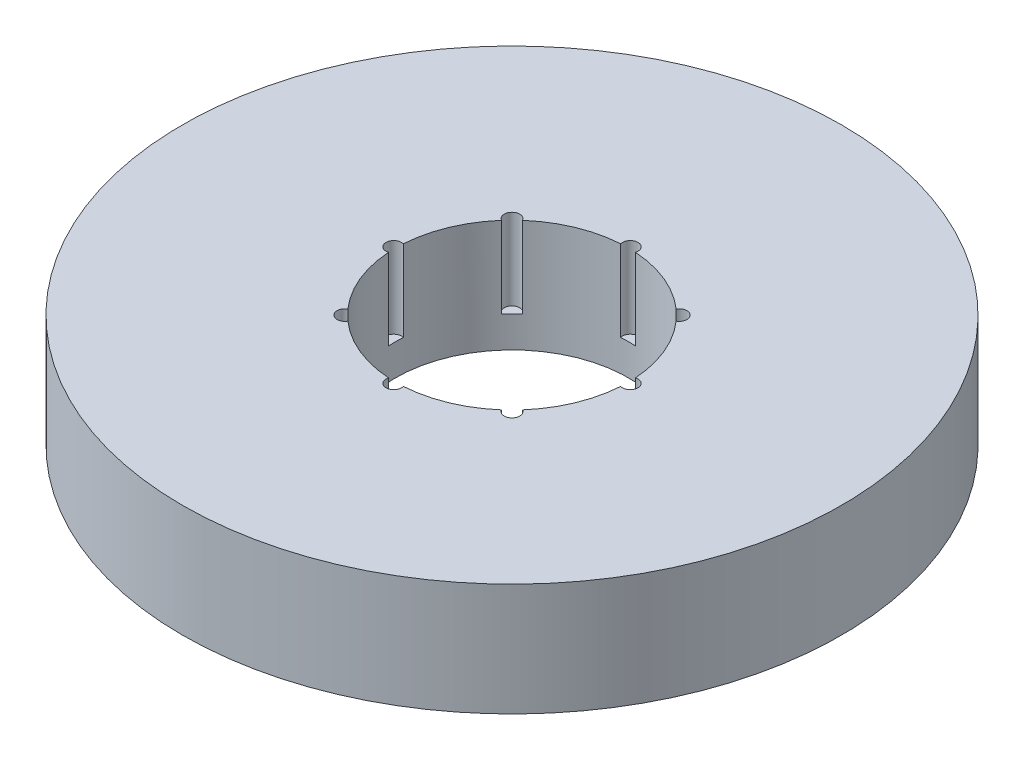
ISO-10303-21;
HEADER;
FILE_DESCRIPTION(('STEP AP214'),'2;1');
FILE_NAME('part.step','',(''),(''),'','','');
FILE_SCHEMA(('AUTOMOTIVE_DESIGN { 1 0 10303 214 1 1 1 1 }'));
ENDSEC;
DATA;
#1=APPLICATION_CONTEXT('core data for automotive mechanical design processes');
#2=APPLICATION_PROTOCOL_DEFINITION('international standard','automotive_design',2000,#1);
#3=PRODUCT_CONTEXT('',#1,'mechanical');
#4=PRODUCT('Part','Part','',(#3));
#5=PRODUCT_RELATED_PRODUCT_CATEGORY('part','',(#4));
#6=PRODUCT_DEFINITION_FORMATION('','',#4);
#7=PRODUCT_DEFINITION_CONTEXT('part definition',#1,'design');
#8=PRODUCT_DEFINITION('design','',#6,#7);
#9=PRODUCT_DEFINITION_SHAPE('','',#8);
#10=(LENGTH_UNIT() NAMED_UNIT(*) SI_UNIT(.MILLI.,.METRE.));
#11=(NAMED_UNIT(*) PLANE_ANGLE_UNIT() SI_UNIT($,.RADIAN.));
#12=(NAMED_UNIT(*) SI_UNIT($,.STERADIAN.) SOLID_ANGLE_UNIT());
#13=UNCERTAINTY_MEASURE_WITH_UNIT(LENGTH_MEASURE(1.E-05),#10,'distance_accuracy_value','');
#14=(GEOMETRIC_REPRESENTATION_CONTEXT(3) GLOBAL_UNCERTAINTY_ASSIGNED_CONTEXT((#13)) GLOBAL_UNIT_ASSIGNED_CONTEXT((#10,
#11,#12)) REPRESENTATION_CONTEXT('',''));
#15=CARTESIAN_POINT('',(0.,0.,0.));
#16=DIRECTION('',(0.,0.,1.));
#17=DIRECTION('',(1.,0.,0.));
#18=AXIS2_PLACEMENT_3D('',#15,#16,#17);
#19=CARTESIAN_POINT('',(0.,29.,0.));
#20=DIRECTION('',(0.,-1.,0.));
#21=DIRECTION('',(0.,0.,-1.));
#22=AXIS2_PLACEMENT_3D('',#19,#20,#21);
#23=CYLINDRICAL_SURFACE('',#22,85.);
#24=CARTESIAN_POINT('',(0.,29.,0.));
#25=DIRECTION('',(0.,1.,0.));
#26=DIRECTION('',(0.,0.,1.));
#27=AXIS2_PLACEMENT_3D('',#24,#25,#26);
#28=CIRCLE('',#27,85.);
#29=CARTESIAN_POINT('',(0.,29.,-85.));
#30=VERTEX_POINT('',#29);
#31=EDGE_CURVE('E195',#30,#30,#28,.T.);
#32=CARTESIAN_POINT('',(0.,0.,0.));
#33=DIRECTION('',(0.,1.,0.));
#34=DIRECTION('',(0.,0.,1.));
#35=AXIS2_PLACEMENT_3D('',#32,#33,#34);
#36=CIRCLE('',#35,85.);
#37=CARTESIAN_POINT('',(0.,0.,-85.));
#38=VERTEX_POINT('',#37);
#39=EDGE_CURVE('E179',#38,#38,#36,.T.);
#40=CARTESIAN_POINT('',(0.,29.,-85.));
#41=CARTESIAN_POINT('',(0.,28.6979166666667,-85.));
#42=CARTESIAN_POINT('',(0.,28.3958333333333,-85.));
#43=CARTESIAN_POINT('',(0.,27.7916666666667,-85.));
#44=CARTESIAN_POINT('',(0.,27.4895833333333,-85.));
#45=CARTESIAN_POINT('',(0.,26.8854166666667,-85.));
#46=CARTESIAN_POINT('',(0.,26.5833333333333,-85.));
#47=CARTESIAN_POINT('',(0.,25.9791666666667,-85.));
#48=CARTESIAN_POINT('',(0.,25.6770833333333,-85.));
#49=CARTESIAN_POINT('',(0.,25.0729166666667,-85.));
#50=CARTESIAN_POINT('',(0.,24.7708333333333,-85.));
#51=CARTESIAN_POINT('',(0.,24.1666666666667,-85.));
#52=CARTESIAN_POINT('',(0.,23.8645833333333,-85.));
#53=CARTESIAN_POINT('',(0.,23.2604166666667,-85.));
#54=CARTESIAN_POINT('',(0.,22.9583333333333,-85.));
#55=CARTESIAN_POINT('',(0.,22.3541666666667,-85.));
#56=CARTESIAN_POINT('',(0.,22.0520833333333,-85.));
#57=CARTESIAN_POINT('',(0.,21.4479166666667,-85.));
#58=CARTESIAN_POINT('',(0.,21.1458333333333,-85.));
#59=CARTESIAN_POINT('',(0.,20.5416666666667,-85.));
#60=CARTESIAN_POINT('',(0.,20.2395833333333,-85.));
#61=CARTESIAN_POINT('',(0.,19.6354166666667,-85.));
#62=CARTESIAN_POINT('',(0.,19.3333333333333,-85.));
#63=CARTESIAN_POINT('',(0.,18.7291666666667,-85.));
#64=CARTESIAN_POINT('',(0.,18.4270833333333,-85.));
#65=CARTESIAN_POINT('',(0.,17.8229166666667,-85.));
#66=CARTESIAN_POINT('',(0.,17.5208333333333,-85.));
#67=CARTESIAN_POINT('',(0.,16.9166666666667,-85.));
#68=CARTESIAN_POINT('',(0.,16.6145833333333,-85.));
#69=CARTESIAN_POINT('',(0.,16.0104166666667,-85.));
#70=CARTESIAN_POINT('',(0.,15.7083333333333,-85.));
#71=CARTESIAN_POINT('',(0.,15.1041666666667,-85.));
#72=CARTESIAN_POINT('',(0.,14.8020833333333,-85.));
#73=CARTESIAN_POINT('',(0.,14.1979166666667,-85.));
#74=CARTESIAN_POINT('',(0.,13.8958333333333,-85.));
#75=CARTESIAN_POINT('',(0.,13.2916666666667,-85.));
#76=CARTESIAN_POINT('',(0.,12.9895833333333,-85.));
#77=CARTESIAN_POINT('',(0.,12.3854166666667,-85.));
#78=CARTESIAN_POINT('',(0.,12.0833333333333,-85.));
#79=CARTESIAN_POINT('',(0.,11.4791666666667,-85.));
#80=CARTESIAN_POINT('',(0.,11.1770833333333,-85.));
#81=CARTESIAN_POINT('',(0.,10.5729166666667,-85.));
#82=CARTESIAN_POINT('',(0.,10.2708333333333,-85.));
#83=CARTESIAN_POINT('',(0.,9.66666666666667,-85.));
#84=CARTESIAN_POINT('',(0.,9.36458333333333,-85.));
#85=CARTESIAN_POINT('',(0.,8.76041666666667,-85.));
#86=CARTESIAN_POINT('',(0.,8.45833333333333,-85.));
#87=CARTESIAN_POINT('',(0.,7.85416666666667,-85.));
#88=CARTESIAN_POINT('',(0.,7.55208333333333,-85.));
#89=CARTESIAN_POINT('',(0.,6.94791666666667,-85.));
#90=CARTESIAN_POINT('',(0.,6.64583333333333,-85.));
#91=CARTESIAN_POINT('',(0.,6.04166666666667,-85.));
#92=CARTESIAN_POINT('',(0.,5.73958333333333,-85.));
#93=CARTESIAN_POINT('',(0.,5.13541666666667,-85.));
#94=CARTESIAN_POINT('',(0.,4.83333333333333,-85.));
#95=CARTESIAN_POINT('',(0.,4.22916666666667,-85.));
#96=CARTESIAN_POINT('',(0.,3.92708333333333,-85.));
#97=CARTESIAN_POINT('',(0.,3.32291666666667,-85.));
#98=CARTESIAN_POINT('',(0.,3.02083333333333,-85.));
#99=CARTESIAN_POINT('',(0.,2.41666666666667,-85.));
#100=CARTESIAN_POINT('',(0.,2.11458333333333,-85.));
#101=CARTESIAN_POINT('',(0.,1.51041666666667,-85.));
#102=CARTESIAN_POINT('',(0.,1.20833333333333,-85.));
#103=CARTESIAN_POINT('',(0.,0.604166666666667,-85.));
#104=CARTESIAN_POINT('',(0.,0.302083333333333,-85.));
#105=CARTESIAN_POINT('',(0.,0.,-85.));
#106=B_SPLINE_CURVE_WITH_KNOTS('',3,(#40,#41,#42,#43,#44,#45,#46,#47,#48,#49,#50,#51,#52,#53,
#54,#55,#56,#57,#58,#59,#60,#61,#62,#63,#64,#65,#66,#67,#68,#69,#70,#71,#72,#73,#74,#75,#76,#77,
#78,#79,#80,#81,#82,#83,#84,#85,#86,#87,#88,#89,#90,#91,#92,#93,#94,#95,#96,#97,#98,#99,#100,
#101,#102,#103,#104,#105),.UNSPECIFIED.,.F.,.F.,(4,2,2,2,2,2,2,2,2,2,2,2,2,2,2,2,2,2,2,2,2,2,2,
2,2,2,2,2,2,2,2,2,4),(0.,0.906249999999997,1.8125,2.71875,3.625,4.53125,5.4375,6.34375,7.25,
8.15625,9.0625,9.96875,10.875,11.78125,12.6875,13.59375,14.5,15.40625,16.3125,17.21875,18.125,
19.03125,19.9375,20.84375,21.75,22.65625,23.5625,24.46875,25.375,26.28125,27.1875,28.09375,29.),.UNSPECIFIED.);
#107=EDGE_CURVE('BSEAM39',#30,#38,#106,.T.);
#108=ORIENTED_EDGE('',*,*,#31,.F.);
#109=ORIENTED_EDGE('',*,*,#39,.T.);
#110=ORIENTED_EDGE('',*,*,#107,.T.);
#111=ORIENTED_EDGE('',*,*,#107,.F.);
#112=EDGE_LOOP('',(#108,#110,#109,#111));
#113=FACE_BOUND('',#112,.T.);
#114=ADVANCED_FACE('F39',(#113),#23,.T.);
#115=CARTESIAN_POINT('',(0.,29.,0.));
#116=DIRECTION('',(0.,1.,0.));
#117=DIRECTION('',(0.,0.,1.));
#118=AXIS2_PLACEMENT_3D('',#115,#116,#117);
#119=PLANE('',#118);
#120=CARTESIAN_POINT('',(1.06495315442341E-13,29.,30.5014706100726));
#121=DIRECTION('',(0.,1.,0.));
#122=DIRECTION('',(1.,0.,0.));
#123=AXIS2_PLACEMENT_3D('',#120,#121,#122);
#124=CIRCLE('',#123,1.9862411111169);
#125=CARTESIAN_POINT('',(-1.90506888417006,29.,29.9394507722932));
#126=VERTEX_POINT('',#125);
#127=CARTESIAN_POINT('',(1.90506888417026,29.,29.9394507722932));
#128=VERTEX_POINT('',#127);
#129=EDGE_CURVE('E176',#126,#128,#124,.T.);
#130=ORIENTED_EDGE('',*,*,#129,.F.);
#131=CARTESIAN_POINT('',(0.,29.,0.));
#132=DIRECTION('',(0.,1.,0.));
#133=DIRECTION('',(0.,0.,1.));
#134=AXIS2_PLACEMENT_3D('',#131,#132,#133);
#135=CIRCLE('',#134,30.);
#136=CARTESIAN_POINT('',(-19.8233015394651,29.,22.5174757927136));
#137=VERTEX_POINT('',#136);
#138=EDGE_CURVE('E166',#137,#126,#135,.T.);
#139=ORIENTED_EDGE('',*,*,#138,.F.);
#140=CARTESIAN_POINT('',(-21.5677967045444,29.,21.5677967045445));
#141=DIRECTION('',(0.,1.,0.));
#142=DIRECTION('',(0.707106781186549,0.,0.707106781186546));
#143=AXIS2_PLACEMENT_3D('',#140,#141,#142);
#144=CIRCLE('',#143,1.9862411111169);
#145=CARTESIAN_POINT('',(-22.5174757927135,29.,19.8233015394652));
#146=VERTEX_POINT('',#145);
#147=EDGE_CURVE('E147',#146,#137,#144,.T.);
#148=ORIENTED_EDGE('',*,*,#147,.F.);
#149=CARTESIAN_POINT('',(-29.9394507722932,29.,1.90506888417016));
#150=VERTEX_POINT('',#149);
#151=EDGE_CURVE('E180',#150,#146,#135,.T.);
#152=ORIENTED_EDGE('',*,*,#151,.F.);
#153=CARTESIAN_POINT('',(-30.5014706100726,29.,0.));
#154=DIRECTION('',(0.,1.,0.));
#155=DIRECTION('',(0.,0.,1.));
#156=AXIS2_PLACEMENT_3D('',#153,#154,#155);
#157=CIRCLE('',#156,1.9862411111169);
#158=CARTESIAN_POINT('',(-29.9394507722932,29.,-1.90506888417016));
#159=VERTEX_POINT('',#158);
#160=EDGE_CURVE('E186',#159,#150,#157,.T.);
#161=ORIENTED_EDGE('',*,*,#160,.F.);
#162=CARTESIAN_POINT('',(-22.5174757927138,29.,-19.8233015394648));
#163=VERTEX_POINT('',#162);
#164=EDGE_CURVE('E182',#163,#159,#135,.T.);
#165=ORIENTED_EDGE('',*,*,#164,.F.);
#166=CARTESIAN_POINT('',(-21.5677967045447,29.,-21.5677967045442));
#167=DIRECTION('',(0.,1.,0.));
#168=DIRECTION('',(-0.707106781186539,0.,0.707106781186556));
#169=AXIS2_PLACEMENT_3D('',#166,#167,#168);
#170=CIRCLE('',#169,1.9862411111169);
#171=CARTESIAN_POINT('',(-19.8233015394654,29.,-22.5174757927133));
#172=VERTEX_POINT('',#171);
#173=EDGE_CURVE('E446',#172,#163,#170,.T.);
#174=ORIENTED_EDGE('',*,*,#173,.F.);
#175=CARTESIAN_POINT('',(-1.90506888417047,29.,-29.9394507722932));
#176=VERTEX_POINT('',#175);
#177=EDGE_CURVE('E452',#176,#172,#135,.T.);
#178=ORIENTED_EDGE('',*,*,#177,.F.);
#179=CARTESIAN_POINT('',(-3.19485946327022E-13,29.,-30.5014706100726));
#180=DIRECTION('',(0.,1.,0.));
#181=DIRECTION('',(-1.,0.,0.));
#182=AXIS2_PLACEMENT_3D('',#179,#180,#181);
#183=CIRCLE('',#182,1.9862411111169);
#184=CARTESIAN_POINT('',(1.90506888416985,29.,-29.9394507722932));
#185=VERTEX_POINT('',#184);
#186=EDGE_CURVE('E477',#185,#176,#183,.T.);
#187=ORIENTED_EDGE('',*,*,#186,.F.);
#188=CARTESIAN_POINT('',(19.8233015394649,29.,-22.5174757927137));
#189=VERTEX_POINT('',#188);
#190=EDGE_CURVE('E460',#189,#185,#135,.T.);
#191=ORIENTED_EDGE('',*,*,#190,.F.);
#192=CARTESIAN_POINT('',(21.5677967045443,29.,-21.5677967045447));
#193=DIRECTION('',(0.,1.,0.));
#194=DIRECTION('',(-0.707106781186554,0.,-0.707106781186541));
#195=AXIS2_PLACEMENT_3D('',#192,#193,#194);
#196=CIRCLE('',#195,1.9862411111169);
#197=CARTESIAN_POINT('',(22.5174757927134,29.,-19.8233015394653));
#198=VERTEX_POINT('',#197);
#199=EDGE_CURVE('E464',#198,#189,#196,.T.);
#200=ORIENTED_EDGE('',*,*,#199,.F.);
#201=CARTESIAN_POINT('',(29.9394507722932,29.,-1.90506888417016));
#202=VERTEX_POINT('',#201);
#203=EDGE_CURVE('E459',#202,#198,#135,.T.);
#204=ORIENTED_EDGE('',*,*,#203,.F.);
#205=CARTESIAN_POINT('',(30.5014706100726,29.,0.));
#206=DIRECTION('',(0.,1.,0.));
#207=DIRECTION('',(0.,0.,-1.));
#208=AXIS2_PLACEMENT_3D('',#205,#206,#207);
#209=CIRCLE('',#208,1.9862411111169);
#210=CARTESIAN_POINT('',(29.9394507722932,29.,1.90506888417016));
#211=VERTEX_POINT('',#210);
#212=EDGE_CURVE('E469',#211,#202,#209,.T.);
#213=ORIENTED_EDGE('',*,*,#212,.F.);
#214=CARTESIAN_POINT('',(22.5174757927136,29.,19.823301539465));
#215=VERTEX_POINT('',#214);
#216=EDGE_CURVE('E181',#215,#211,#135,.T.);
#217=ORIENTED_EDGE('',*,*,#216,.F.);
#218=CARTESIAN_POINT('',(21.5677967045446,29.,21.5677967045444));
#219=DIRECTION('',(0.,1.,0.));
#220=DIRECTION('',(0.707106781186544,0.,-0.707106781186551));
#221=AXIS2_PLACEMENT_3D('',#218,#219,#220);
#222=CIRCLE('',#221,1.9862411111169);
#223=CARTESIAN_POINT('',(19.8233015394652,29.,22.5174757927134));
#224=VERTEX_POINT('',#223);
#225=EDGE_CURVE('E475',#224,#215,#222,.T.);
#226=ORIENTED_EDGE('',*,*,#225,.F.);
#227=EDGE_CURVE('E177',#128,#224,#135,.T.);
#228=ORIENTED_EDGE('',*,*,#227,.F.);
#229=EDGE_LOOP('',(#130,#139,#148,#152,#161,#165,#174,#178,#187,#191,#200,#204,#213,#217,#226,#228));
#230=FACE_BOUND('',#229,.T.);
#231=ORIENTED_EDGE('',*,*,#31,.T.);
#232=EDGE_LOOP('',(#231));
#233=FACE_BOUND('',#232,.T.);
#234=ADVANCED_FACE('F172',(#230,#233),#119,.T.);
#235=CARTESIAN_POINT('',(0.,0.,0.));
#236=DIRECTION('',(0.,1.,0.));
#237=DIRECTION('',(0.,0.,1.));
#238=AXIS2_PLACEMENT_3D('',#235,#236,#237);
#239=PLANE('',#238);
#240=CARTESIAN_POINT('',(0.,0.,0.));
#241=DIRECTION('',(0.,1.,0.));
#242=DIRECTION('',(0.,0.,1.));
#243=AXIS2_PLACEMENT_3D('',#240,#241,#242);
#244=CIRCLE('',#243,30.);
#245=CARTESIAN_POINT('',(0.,0.,30.));
#246=VERTEX_POINT('',#245);
#247=EDGE_CURVE('E187',#246,#246,#244,.T.);
#248=ORIENTED_EDGE('',*,*,#247,.T.);
#249=EDGE_LOOP('',(#248));
#250=FACE_BOUND('',#249,.T.);
#251=ORIENTED_EDGE('',*,*,#39,.F.);
#252=EDGE_LOOP('',(#251));
#253=FACE_BOUND('',#252,.T.);
#254=ADVANCED_FACE('F270',(#250,#253),#239,.F.);
#255=CARTESIAN_POINT('',(0.,29.,0.));
#256=DIRECTION('',(0.,-1.,0.));
#257=DIRECTION('',(0.,0.,-1.));
#258=AXIS2_PLACEMENT_3D('',#255,#256,#257);
#259=CYLINDRICAL_SURFACE('',#258,30.);
#260=DIRECTION('',(0.,1.,0.));
#261=VECTOR('',#260,1.);
#262=CARTESIAN_POINT('',(-1.90506888417005,18.5391863547704,29.9394507722932));
#263=LINE('',#262,#261);
#264=CARTESIAN_POINT('',(-1.90506888417006,8.07837270954081,29.9394507722932));
#265=VERTEX_POINT('',#264);
#266=EDGE_CURVE('E11',#265,#126,#263,.T.);
#267=ORIENTED_EDGE('',*,*,#266,.F.);
#268=CARTESIAN_POINT('',(0.,8.07837270954081,0.));
#269=DIRECTION('',(0.,1.,0.));
#270=DIRECTION('',(0.,0.,1.));
#271=AXIS2_PLACEMENT_3D('',#268,#269,#270);
#272=CIRCLE('',#271,30.);
#273=CARTESIAN_POINT('',(1.90506888417026,8.07837270954081,29.9394507722932));
#274=VERTEX_POINT('',#273);
#275=EDGE_CURVE('E250',#265,#274,#272,.T.);
#276=ORIENTED_EDGE('',*,*,#275,.T.);
#277=DIRECTION('',(0.,1.,0.));
#278=VECTOR('',#277,1.);
#279=CARTESIAN_POINT('',(1.90506888417026,18.5391863547704,29.9394507722932));
#280=LINE('',#279,#278);
#281=EDGE_CURVE('E46',#128,#274,#280,.F.);
#282=ORIENTED_EDGE('',*,*,#281,.F.);
#283=ORIENTED_EDGE('',*,*,#227,.T.);
#284=DIRECTION('',(0.,1.,0.));
#285=VECTOR('',#284,1.);
#286=CARTESIAN_POINT('',(19.8233015394652,18.5391863547704,22.5174757927134));
#287=LINE('',#286,#285);
#288=CARTESIAN_POINT('',(19.8233015394652,8.07837270954081,22.5174757927134));
#289=VERTEX_POINT('',#288);
#290=EDGE_CURVE('E244',#289,#224,#287,.T.);
#291=ORIENTED_EDGE('',*,*,#290,.F.);
#292=CARTESIAN_POINT('',(0.,8.07837270954081,0.));
#293=DIRECTION('',(0.,1.,0.));
#294=DIRECTION('',(0.,0.,1.));
#295=AXIS2_PLACEMENT_3D('',#292,#293,#294);
#296=CIRCLE('',#295,30.);
#297=CARTESIAN_POINT('',(22.5174757927136,8.07837270954081,19.823301539465));
#298=VERTEX_POINT('',#297);
#299=EDGE_CURVE('E238',#289,#298,#296,.T.);
#300=ORIENTED_EDGE('',*,*,#299,.T.);
#301=DIRECTION('',(0.,1.,0.));
#302=VECTOR('',#301,1.);
#303=CARTESIAN_POINT('',(22.5174757927136,18.5391863547704,19.823301539465));
#304=LINE('',#303,#302);
#305=EDGE_CURVE('E242',#215,#298,#304,.F.);
#306=ORIENTED_EDGE('',*,*,#305,.F.);
#307=ORIENTED_EDGE('',*,*,#216,.T.);
#308=DIRECTION('',(0.,1.,0.));
#309=VECTOR('',#308,1.);
#310=CARTESIAN_POINT('',(29.9394507722932,18.5391863547704,1.90506888417016));
#311=LINE('',#310,#309);
#312=CARTESIAN_POINT('',(29.9394507722932,8.07837270954081,1.90506888417016));
#313=VERTEX_POINT('',#312);
#314=EDGE_CURVE('E236',#313,#211,#311,.T.);
#315=ORIENTED_EDGE('',*,*,#314,.F.);
#316=CARTESIAN_POINT('',(0.,8.07837270954081,0.));
#317=DIRECTION('',(0.,1.,0.));
#318=DIRECTION('',(0.,0.,1.));
#319=AXIS2_PLACEMENT_3D('',#316,#317,#318);
#320=CIRCLE('',#319,30.);
#321=CARTESIAN_POINT('',(29.9394507722932,8.07837270954081,-1.90506888417016));
#322=VERTEX_POINT('',#321);
#323=EDGE_CURVE('E235',#313,#322,#320,.T.);
#324=ORIENTED_EDGE('',*,*,#323,.T.);
#325=DIRECTION('',(0.,1.,0.));
#326=VECTOR('',#325,1.);
#327=CARTESIAN_POINT('',(29.9394507722932,18.5391863547704,-1.90506888417016));
#328=LINE('',#327,#326);
#329=EDGE_CURVE('E234',#202,#322,#328,.F.);
#330=ORIENTED_EDGE('',*,*,#329,.F.);
#331=ORIENTED_EDGE('',*,*,#203,.T.);
#332=DIRECTION('',(0.,1.,0.));
#333=VECTOR('',#332,1.);
#334=CARTESIAN_POINT('',(22.5174757927134,18.5391863547704,-19.8233015394653));
#335=LINE('',#334,#333);
#336=CARTESIAN_POINT('',(22.5174757927134,8.07837270954081,-19.8233015394653));
#337=VERTEX_POINT('',#336);
#338=EDGE_CURVE('E229',#337,#198,#335,.T.);
#339=ORIENTED_EDGE('',*,*,#338,.F.);
#340=CARTESIAN_POINT('',(0.,8.07837270954081,0.));
#341=DIRECTION('',(0.,1.,0.));
#342=DIRECTION('',(0.,0.,1.));
#343=AXIS2_PLACEMENT_3D('',#340,#341,#342);
#344=CIRCLE('',#343,30.);
#345=CARTESIAN_POINT('',(19.8233015394649,8.07837270954081,-22.5174757927137));
#346=VERTEX_POINT('',#345);
#347=EDGE_CURVE('E221',#337,#346,#344,.T.);
#348=ORIENTED_EDGE('',*,*,#347,.T.);
#349=DIRECTION('',(0.,1.,0.));
#350=VECTOR('',#349,1.);
#351=CARTESIAN_POINT('',(19.8233015394649,18.5391863547704,-22.5174757927137));
#352=LINE('',#351,#350);
#353=EDGE_CURVE('E230',#189,#346,#352,.F.);
#354=ORIENTED_EDGE('',*,*,#353,.F.);
#355=ORIENTED_EDGE('',*,*,#190,.T.);
#356=DIRECTION('',(0.,1.,0.));
#357=VECTOR('',#356,1.);
#358=CARTESIAN_POINT('',(1.90506888416984,18.5391863547704,-29.9394507722932));
#359=LINE('',#358,#357);
#360=CARTESIAN_POINT('',(1.90506888416985,8.07837270954081,-29.9394507722932));
#361=VERTEX_POINT('',#360);
#362=EDGE_CURVE('E225',#361,#185,#359,.T.);
#363=ORIENTED_EDGE('',*,*,#362,.F.);
#364=CARTESIAN_POINT('',(0.,8.07837270954081,0.));
#365=DIRECTION('',(0.,1.,0.));
#366=DIRECTION('',(0.,0.,1.));
#367=AXIS2_PLACEMENT_3D('',#364,#365,#366);
#368=CIRCLE('',#367,30.);
#369=CARTESIAN_POINT('',(-1.90506888417047,8.07837270954081,-29.9394507722932));
#370=VERTEX_POINT('',#369);
#371=EDGE_CURVE('E216',#361,#370,#368,.T.);
#372=ORIENTED_EDGE('',*,*,#371,.T.);
#373=DIRECTION('',(0.,1.,0.));
#374=VECTOR('',#373,1.);
#375=CARTESIAN_POINT('',(-1.90506888417047,18.5391863547704,-29.9394507722932));
#376=LINE('',#375,#374);
#377=EDGE_CURVE('E218',#176,#370,#376,.F.);
#378=ORIENTED_EDGE('',*,*,#377,.F.);
#379=ORIENTED_EDGE('',*,*,#177,.T.);
#380=DIRECTION('',(0.,1.,0.));
#381=VECTOR('',#380,1.);
#382=CARTESIAN_POINT('',(-19.8233015394654,18.5391863547704,-22.5174757927133));
#383=LINE('',#382,#381);
#384=CARTESIAN_POINT('',(-19.8233015394654,8.07837270954081,-22.5174757927133));
#385=VERTEX_POINT('',#384);
#386=EDGE_CURVE('E212',#385,#172,#383,.T.);
#387=ORIENTED_EDGE('',*,*,#386,.F.);
#388=CARTESIAN_POINT('',(0.,8.07837270954081,0.));
#389=DIRECTION('',(0.,1.,0.));
#390=DIRECTION('',(0.,0.,1.));
#391=AXIS2_PLACEMENT_3D('',#388,#389,#390);
#392=CIRCLE('',#391,30.);
#393=CARTESIAN_POINT('',(-22.5174757927138,8.07837270954081,-19.8233015394648));
#394=VERTEX_POINT('',#393);
#395=EDGE_CURVE('E208',#385,#394,#392,.T.);
#396=ORIENTED_EDGE('',*,*,#395,.T.);
#397=DIRECTION('',(0.,1.,0.));
#398=VECTOR('',#397,1.);
#399=CARTESIAN_POINT('',(-22.5174757927138,18.5391863547704,-19.8233015394648));
#400=LINE('',#399,#398);
#401=EDGE_CURVE('E211',#163,#394,#400,.F.);
#402=ORIENTED_EDGE('',*,*,#401,.F.);
#403=ORIENTED_EDGE('',*,*,#164,.T.);
#404=DIRECTION('',(0.,1.,0.));
#405=VECTOR('',#404,1.);
#406=CARTESIAN_POINT('',(-29.9394507722932,18.5391863547704,-1.90506888417016));
#407=LINE('',#406,#405);
#408=CARTESIAN_POINT('',(-29.9394507722932,8.07837270954081,-1.90506888417016));
#409=VERTEX_POINT('',#408);
#410=EDGE_CURVE('E201',#409,#159,#407,.T.);
#411=ORIENTED_EDGE('',*,*,#410,.F.);
#412=CARTESIAN_POINT('',(0.,8.07837270954081,0.));
#413=DIRECTION('',(0.,1.,0.));
#414=DIRECTION('',(0.,0.,1.));
#415=AXIS2_PLACEMENT_3D('',#412,#413,#414);
#416=CIRCLE('',#415,30.);
#417=CARTESIAN_POINT('',(-29.9394507722932,8.07837270954081,1.90506888417016));
#418=VERTEX_POINT('',#417);
#419=EDGE_CURVE('E194',#409,#418,#416,.T.);
#420=ORIENTED_EDGE('',*,*,#419,.T.);
#421=DIRECTION('',(0.,1.,0.));
#422=VECTOR('',#421,1.);
#423=CARTESIAN_POINT('',(-29.9394507722932,18.5391863547704,1.90506888417016));
#424=LINE('',#423,#422);
#425=EDGE_CURVE('E199',#150,#418,#424,.F.);
#426=ORIENTED_EDGE('',*,*,#425,.F.);
#427=ORIENTED_EDGE('',*,*,#151,.T.);
#428=DIRECTION('',(0.,1.,0.));
#429=VECTOR('',#428,1.);
#430=CARTESIAN_POINT('',(-22.5174757927135,18.5391863547704,19.8233015394651));
#431=LINE('',#430,#429);
#432=CARTESIAN_POINT('',(-22.5174757927135,8.07837270954081,19.8233015394652));
#433=VERTEX_POINT('',#432);
#434=EDGE_CURVE('E160',#433,#146,#431,.T.);
#435=ORIENTED_EDGE('',*,*,#434,.F.);
#436=CARTESIAN_POINT('',(0.,8.07837270954081,0.));
#437=DIRECTION('',(0.,1.,0.));
#438=DIRECTION('',(0.,0.,1.));
#439=AXIS2_PLACEMENT_3D('',#436,#437,#438);
#440=CIRCLE('',#439,30.);
#441=CARTESIAN_POINT('',(-19.8233015394651,8.07837270954081,22.5174757927136));
#442=VERTEX_POINT('',#441);
#443=EDGE_CURVE('E168',#433,#442,#440,.T.);
#444=ORIENTED_EDGE('',*,*,#443,.T.);
#445=DIRECTION('',(0.,1.,0.));
#446=VECTOR('',#445,1.);
#447=CARTESIAN_POINT('',(-19.8233015394651,18.5391863547704,22.5174757927136));
#448=LINE('',#447,#446);
#449=EDGE_CURVE('E152',#137,#442,#448,.F.);
#450=ORIENTED_EDGE('',*,*,#449,.F.);
#451=ORIENTED_EDGE('',*,*,#138,.T.);
#452=EDGE_LOOP('',(#267,#276,#282,#283,#291,#300,#306,#307,#315,#324,#330,#331,#339,#348,#354,
#355,#363,#372,#378,#379,#387,#396,#402,#403,#411,#420,#426,#427,#435,#444,#450,#451));
#453=FACE_BOUND('',#452,.T.);
#454=ORIENTED_EDGE('',*,*,#247,.F.);
#455=EDGE_LOOP('',(#454));
#456=FACE_BOUND('',#455,.T.);
#457=ADVANCED_FACE('F170',(#453,#456),#259,.F.);
#458=CARTESIAN_POINT('',(-30.5014706100726,8.07837270954081,0.));
#459=DIRECTION('',(0.,1.,0.));
#460=DIRECTION('',(0.,0.,1.));
#461=AXIS2_PLACEMENT_3D('',#458,#459,#460);
#462=CYLINDRICAL_SURFACE('',#461,1.9862411111169);
#463=ORIENTED_EDGE('',*,*,#410,.T.);
#464=ORIENTED_EDGE('',*,*,#160,.T.);
#465=ORIENTED_EDGE('',*,*,#425,.T.);
#466=CARTESIAN_POINT('',(-30.5014706100726,8.07837270954081,0.));
#467=DIRECTION('',(0.,1.,0.));
#468=DIRECTION('',(0.,0.,1.));
#469=AXIS2_PLACEMENT_3D('',#466,#467,#468);
#470=CIRCLE('',#469,1.9862411111169);
#471=EDGE_CURVE('E191',#409,#418,#470,.T.);
#472=ORIENTED_EDGE('',*,*,#471,.F.);
#473=EDGE_LOOP('',(#463,#464,#465,#472));
#474=FACE_BOUND('',#473,.T.);
#475=ADVANCED_FACE('F279',(#474),#462,.F.);
#476=CARTESIAN_POINT('',(-30.5014706100726,8.07837270954081,0.));
#477=DIRECTION('',(0.,1.,0.));
#478=DIRECTION('',(0.,0.,1.));
#479=AXIS2_PLACEMENT_3D('',#476,#477,#478);
#480=PLANE('',#479);
#481=ORIENTED_EDGE('',*,*,#471,.T.);
#482=ORIENTED_EDGE('',*,*,#419,.F.);
#483=EDGE_LOOP('',(#481,#482));
#484=FACE_BOUND('',#483,.T.);
#485=ADVANCED_FACE('F285',(#484),#480,.T.);
#486=CARTESIAN_POINT('',(-21.5677967045444,8.07837270954081,21.5677967045445));
#487=DIRECTION('',(0.,1.,0.));
#488=DIRECTION('',(0.,0.,1.));
#489=AXIS2_PLACEMENT_3D('',#486,#487,#488);
#490=CYLINDRICAL_SURFACE('',#489,1.9862411111169);
#491=ORIENTED_EDGE('',*,*,#434,.T.);
#492=ORIENTED_EDGE('',*,*,#147,.T.);
#493=ORIENTED_EDGE('',*,*,#449,.T.);
#494=CARTESIAN_POINT('',(-21.5677967045444,8.07837270954081,21.5677967045445));
#495=DIRECTION('',(0.,1.,0.));
#496=DIRECTION('',(0.707106781186549,0.,0.707106781186546));
#497=AXIS2_PLACEMENT_3D('',#494,#495,#496);
#498=CIRCLE('',#497,1.9862411111169);
#499=EDGE_CURVE('E165',#433,#442,#498,.T.);
#500=ORIENTED_EDGE('',*,*,#499,.F.);
#501=EDGE_LOOP('',(#491,#492,#493,#500));
#502=FACE_BOUND('',#501,.T.);
#503=ADVANCED_FACE('F155',(#502),#490,.F.);
#504=CARTESIAN_POINT('',(-21.5677967045444,8.07837270954081,21.5677967045445));
#505=DIRECTION('',(0.,1.,0.));
#506=DIRECTION('',(0.707106781186549,0.,0.707106781186546));
#507=AXIS2_PLACEMENT_3D('',#504,#505,#506);
#508=PLANE('',#507);
#509=ORIENTED_EDGE('',*,*,#499,.T.);
#510=ORIENTED_EDGE('',*,*,#443,.F.);
#511=EDGE_LOOP('',(#509,#510));
#512=FACE_BOUND('',#511,.T.);
#513=ADVANCED_FACE('F288',(#512),#508,.T.);
#514=CARTESIAN_POINT('',(-21.5677967045447,8.07837270954081,-21.5677967045442));
#515=DIRECTION('',(0.,1.,0.));
#516=DIRECTION('',(0.,0.,1.));
#517=AXIS2_PLACEMENT_3D('',#514,#515,#516);
#518=CYLINDRICAL_SURFACE('',#517,1.9862411111169);
#519=ORIENTED_EDGE('',*,*,#386,.T.);
#520=ORIENTED_EDGE('',*,*,#173,.T.);
#521=ORIENTED_EDGE('',*,*,#401,.T.);
#522=CARTESIAN_POINT('',(-21.5677967045447,8.07837270954081,-21.5677967045442));
#523=DIRECTION('',(0.,1.,0.));
#524=DIRECTION('',(-0.707106781186539,0.,0.707106781186556));
#525=AXIS2_PLACEMENT_3D('',#522,#523,#524);
#526=CIRCLE('',#525,1.9862411111169);
#527=EDGE_CURVE('E447',#385,#394,#526,.T.);
#528=ORIENTED_EDGE('',*,*,#527,.F.);
#529=EDGE_LOOP('',(#519,#520,#521,#528));
#530=FACE_BOUND('',#529,.T.);
#531=ADVANCED_FACE('F295',(#530),#518,.F.);
#532=CARTESIAN_POINT('',(-21.5677967045447,8.07837270954081,-21.5677967045442));
#533=DIRECTION('',(0.,1.,0.));
#534=DIRECTION('',(-0.707106781186539,0.,0.707106781186556));
#535=AXIS2_PLACEMENT_3D('',#532,#533,#534);
#536=PLANE('',#535);
#537=ORIENTED_EDGE('',*,*,#527,.T.);
#538=ORIENTED_EDGE('',*,*,#395,.F.);
#539=EDGE_LOOP('',(#537,#538));
#540=FACE_BOUND('',#539,.T.);
#541=ADVANCED_FACE('F375',(#540),#536,.T.);
#542=CARTESIAN_POINT('',(-3.19485946327022E-13,8.07837270954081,-30.5014706100726));
#543=DIRECTION('',(0.,1.,0.));
#544=DIRECTION('',(0.,0.,1.));
#545=AXIS2_PLACEMENT_3D('',#542,#543,#544);
#546=CYLINDRICAL_SURFACE('',#545,1.9862411111169);
#547=ORIENTED_EDGE('',*,*,#362,.T.);
#548=ORIENTED_EDGE('',*,*,#186,.T.);
#549=ORIENTED_EDGE('',*,*,#377,.T.);
#550=CARTESIAN_POINT('',(-3.19485946327022E-13,8.07837270954081,-30.5014706100726));
#551=DIRECTION('',(0.,1.,0.));
#552=DIRECTION('',(-1.,0.,0.));
#553=AXIS2_PLACEMENT_3D('',#550,#551,#552);
#554=CIRCLE('',#553,1.9862411111169);
#555=EDGE_CURVE('E467',#361,#370,#554,.T.);
#556=ORIENTED_EDGE('',*,*,#555,.F.);
#557=EDGE_LOOP('',(#547,#548,#549,#556));
#558=FACE_BOUND('',#557,.T.);
#559=ADVANCED_FACE('F361',(#558),#546,.F.);
#560=CARTESIAN_POINT('',(-3.19485946327022E-13,8.07837270954081,-30.5014706100726));
#561=DIRECTION('',(0.,1.,0.));
#562=DIRECTION('',(-1.,0.,0.));
#563=AXIS2_PLACEMENT_3D('',#560,#561,#562);
#564=PLANE('',#563);
#565=ORIENTED_EDGE('',*,*,#555,.T.);
#566=ORIENTED_EDGE('',*,*,#371,.F.);
#567=EDGE_LOOP('',(#565,#566));
#568=FACE_BOUND('',#567,.T.);
#569=ADVANCED_FACE('F297',(#568),#564,.T.);
#570=CARTESIAN_POINT('',(21.5677967045443,8.07837270954081,-21.5677967045447));
#571=DIRECTION('',(0.,1.,0.));
#572=DIRECTION('',(0.,0.,1.));
#573=AXIS2_PLACEMENT_3D('',#570,#571,#572);
#574=CYLINDRICAL_SURFACE('',#573,1.9862411111169);
#575=ORIENTED_EDGE('',*,*,#338,.T.);
#576=ORIENTED_EDGE('',*,*,#199,.T.);
#577=ORIENTED_EDGE('',*,*,#353,.T.);
#578=CARTESIAN_POINT('',(21.5677967045443,8.07837270954081,-21.5677967045447));
#579=DIRECTION('',(0.,1.,0.));
#580=DIRECTION('',(-0.707106781186554,0.,-0.707106781186541));
#581=AXIS2_PLACEMENT_3D('',#578,#579,#580);
#582=CIRCLE('',#581,1.9862411111169);
#583=EDGE_CURVE('E470',#337,#346,#582,.T.);
#584=ORIENTED_EDGE('',*,*,#583,.F.);
#585=EDGE_LOOP('',(#575,#576,#577,#584));
#586=FACE_BOUND('',#585,.T.);
#587=ADVANCED_FACE('F294',(#586),#574,.F.);
#588=CARTESIAN_POINT('',(21.5677967045443,8.07837270954081,-21.5677967045447));
#589=DIRECTION('',(0.,1.,0.));
#590=DIRECTION('',(-0.707106781186554,0.,-0.707106781186541));
#591=AXIS2_PLACEMENT_3D('',#588,#589,#590);
#592=PLANE('',#591);
#593=ORIENTED_EDGE('',*,*,#583,.T.);
#594=ORIENTED_EDGE('',*,*,#347,.F.);
#595=EDGE_LOOP('',(#593,#594));
#596=FACE_BOUND('',#595,.T.);
#597=ADVANCED_FACE('F300',(#596),#592,.T.);
#598=CARTESIAN_POINT('',(30.5014706100726,8.07837270954081,0.));
#599=DIRECTION('',(0.,1.,0.));
#600=DIRECTION('',(0.,0.,1.));
#601=AXIS2_PLACEMENT_3D('',#598,#599,#600);
#602=CYLINDRICAL_SURFACE('',#601,1.9862411111169);
#603=ORIENTED_EDGE('',*,*,#314,.T.);
#604=ORIENTED_EDGE('',*,*,#212,.T.);
#605=ORIENTED_EDGE('',*,*,#329,.T.);
#606=CARTESIAN_POINT('',(30.5014706100726,8.07837270954081,0.));
#607=DIRECTION('',(0.,1.,0.));
#608=DIRECTION('',(0.,0.,-1.));
#609=AXIS2_PLACEMENT_3D('',#606,#607,#608);
#610=CIRCLE('',#609,1.9862411111169);
#611=EDGE_CURVE('E472',#313,#322,#610,.T.);
#612=ORIENTED_EDGE('',*,*,#611,.F.);
#613=EDGE_LOOP('',(#603,#604,#605,#612));
#614=FACE_BOUND('',#613,.T.);
#615=ADVANCED_FACE('F305',(#614),#602,.F.);
#616=CARTESIAN_POINT('',(30.5014706100726,8.07837270954081,0.));
#617=DIRECTION('',(0.,1.,0.));
#618=DIRECTION('',(0.,0.,-1.));
#619=AXIS2_PLACEMENT_3D('',#616,#617,#618);
#620=PLANE('',#619);
#621=ORIENTED_EDGE('',*,*,#611,.T.);
#622=ORIENTED_EDGE('',*,*,#323,.F.);
#623=EDGE_LOOP('',(#621,#622));
#624=FACE_BOUND('',#623,.T.);
#625=ADVANCED_FACE('F308',(#624),#620,.T.);
#626=CARTESIAN_POINT('',(21.5677967045446,8.07837270954081,21.5677967045444));
#627=DIRECTION('',(0.,1.,0.));
#628=DIRECTION('',(0.,0.,1.));
#629=AXIS2_PLACEMENT_3D('',#626,#627,#628);
#630=CYLINDRICAL_SURFACE('',#629,1.9862411111169);
#631=ORIENTED_EDGE('',*,*,#290,.T.);
#632=ORIENTED_EDGE('',*,*,#225,.T.);
#633=ORIENTED_EDGE('',*,*,#305,.T.);
#634=CARTESIAN_POINT('',(21.5677967045446,8.07837270954081,21.5677967045444));
#635=DIRECTION('',(0.,1.,0.));
#636=DIRECTION('',(0.707106781186544,0.,-0.707106781186551));
#637=AXIS2_PLACEMENT_3D('',#634,#635,#636);
#638=CIRCLE('',#637,1.9862411111169);
#639=EDGE_CURVE('E56',#289,#298,#638,.T.);
#640=ORIENTED_EDGE('',*,*,#639,.F.);
#641=EDGE_LOOP('',(#631,#632,#633,#640));
#642=FACE_BOUND('',#641,.T.);
#643=ADVANCED_FACE('F309',(#642),#630,.F.);
#644=CARTESIAN_POINT('',(21.5677967045446,8.07837270954081,21.5677967045444));
#645=DIRECTION('',(0.,1.,0.));
#646=DIRECTION('',(0.707106781186544,0.,-0.707106781186551));
#647=AXIS2_PLACEMENT_3D('',#644,#645,#646);
#648=PLANE('',#647);
#649=ORIENTED_EDGE('',*,*,#639,.T.);
#650=ORIENTED_EDGE('',*,*,#299,.F.);
#651=EDGE_LOOP('',(#649,#650));
#652=FACE_BOUND('',#651,.T.);
#653=ADVANCED_FACE('F256',(#652),#648,.T.);
#654=CARTESIAN_POINT('',(1.06495315442341E-13,8.07837270954081,30.5014706100726));
#655=DIRECTION('',(0.,1.,0.));
#656=DIRECTION('',(0.,0.,1.));
#657=AXIS2_PLACEMENT_3D('',#654,#655,#656);
#658=CYLINDRICAL_SURFACE('',#657,1.9862411111169);
#659=ORIENTED_EDGE('',*,*,#266,.T.);
#660=ORIENTED_EDGE('',*,*,#129,.T.);
#661=ORIENTED_EDGE('',*,*,#281,.T.);
#662=CARTESIAN_POINT('',(1.06495315442341E-13,8.07837270954081,30.5014706100726));
#663=DIRECTION('',(0.,1.,0.));
#664=DIRECTION('',(1.,0.,0.));
#665=AXIS2_PLACEMENT_3D('',#662,#663,#664);
#666=CIRCLE('',#665,1.9862411111169);
#667=EDGE_CURVE('E55',#265,#274,#666,.T.);
#668=ORIENTED_EDGE('',*,*,#667,.F.);
#669=EDGE_LOOP('',(#659,#660,#661,#668));
#670=FACE_BOUND('',#669,.T.);
#671=ADVANCED_FACE('F253',(#670),#658,.F.);
#672=CARTESIAN_POINT('',(1.06495315442341E-13,8.07837270954081,30.5014706100726));
#673=DIRECTION('',(0.,1.,0.));
#674=DIRECTION('',(1.,0.,0.));
#675=AXIS2_PLACEMENT_3D('',#672,#673,#674);
#676=PLANE('',#675);
#677=ORIENTED_EDGE('',*,*,#667,.T.);
#678=ORIENTED_EDGE('',*,*,#275,.F.);
#679=EDGE_LOOP('',(#677,#678));
#680=FACE_BOUND('',#679,.T.);
#681=ADVANCED_FACE('F252',(#680),#676,.T.);
#682=CLOSED_SHELL('',(#114,#234,#254,#457,#475,#485,#503,#513,#531,#541,#559,#569,#587,#597,
#615,#625,#643,#653,#671,#681));
#683=MANIFOLD_SOLID_BREP('B2',#682);
#684=ADVANCED_BREP_SHAPE_REPRESENTATION('',(#18,#683),#14);
#685=SHAPE_DEFINITION_REPRESENTATION(#9,#684);
ENDSEC;
END-ISO-10303-21;
